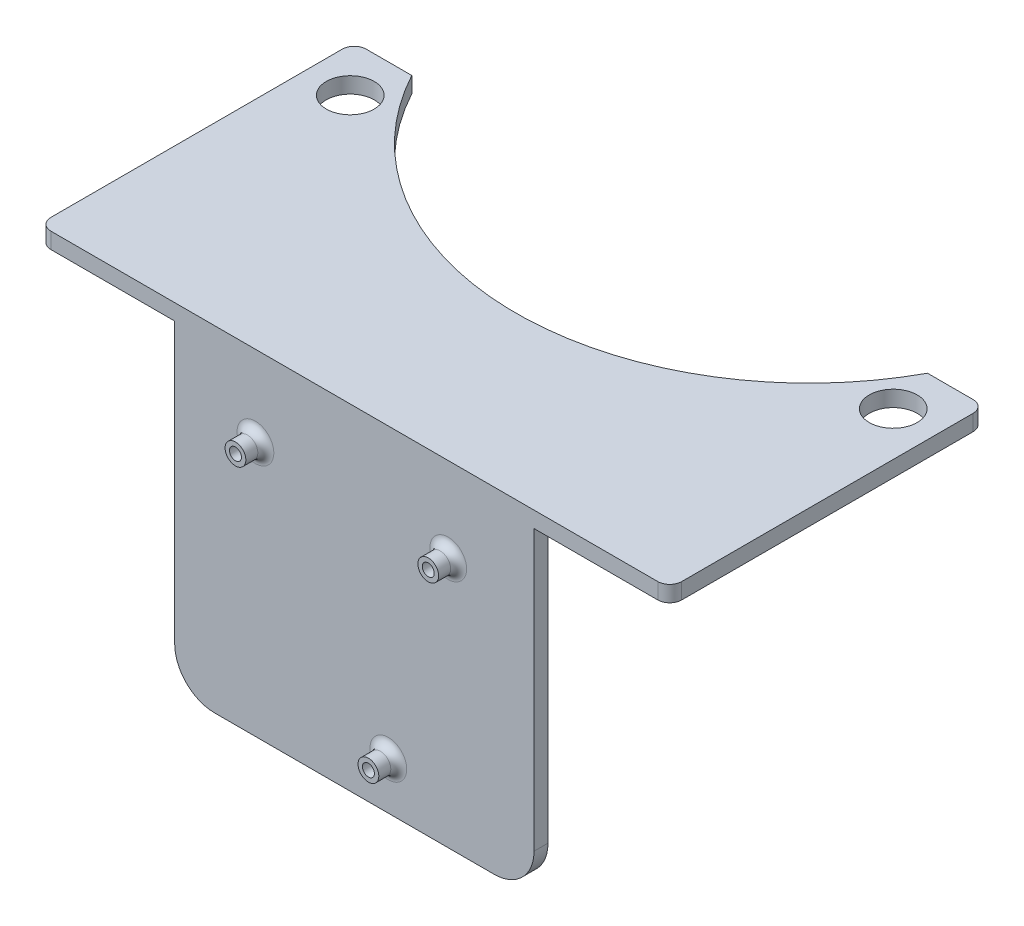
ISO-10303-21;
HEADER;
FILE_DESCRIPTION(('STEP AP214'),'2;1');
FILE_NAME('part.step','',(''),(''),'','','');
FILE_SCHEMA(('AUTOMOTIVE_DESIGN { 1 0 10303 214 1 1 1 1 }'));
ENDSEC;
DATA;
#1=APPLICATION_CONTEXT('core data for automotive mechanical design processes');
#2=APPLICATION_PROTOCOL_DEFINITION('international standard','automotive_design',2000,#1);
#3=PRODUCT_CONTEXT('',#1,'mechanical');
#4=PRODUCT('Part','Part','',(#3));
#5=PRODUCT_RELATED_PRODUCT_CATEGORY('part','',(#4));
#6=PRODUCT_DEFINITION_FORMATION('','',#4);
#7=PRODUCT_DEFINITION_CONTEXT('part definition',#1,'design');
#8=PRODUCT_DEFINITION('design','',#6,#7);
#9=PRODUCT_DEFINITION_SHAPE('','',#8);
#10=(LENGTH_UNIT() NAMED_UNIT(*) SI_UNIT(.MILLI.,.METRE.));
#11=(NAMED_UNIT(*) PLANE_ANGLE_UNIT() SI_UNIT($,.RADIAN.));
#12=(NAMED_UNIT(*) SI_UNIT($,.STERADIAN.) SOLID_ANGLE_UNIT());
#13=UNCERTAINTY_MEASURE_WITH_UNIT(LENGTH_MEASURE(1.E-05),#10,'distance_accuracy_value','');
#14=(GEOMETRIC_REPRESENTATION_CONTEXT(3) GLOBAL_UNCERTAINTY_ASSIGNED_CONTEXT((#13)) GLOBAL_UNIT_ASSIGNED_CONTEXT((#10,
#11,#12)) REPRESENTATION_CONTEXT('',''));
#15=CARTESIAN_POINT('',(0.,0.,0.));
#16=DIRECTION('',(0.,0.,1.));
#17=DIRECTION('',(1.,0.,0.));
#18=AXIS2_PLACEMENT_3D('',#15,#16,#17);
#19=CARTESIAN_POINT('',(-76.,0.,-84.4920957772645));
#20=DIRECTION('',(0.,-1.,0.));
#21=DIRECTION('',(0.,0.,-1.));
#22=AXIS2_PLACEMENT_3D('',#19,#20,#21);
#23=PLANE('',#22);
#24=DIRECTION('',(-1.,0.,0.));
#25=VECTOR('',#24,1.);
#26=CARTESIAN_POINT('',(-76.,0.,-30.3194952335633));
#27=LINE('',#26,#25);
#28=CARTESIAN_POINT('',(14.5,0.,-30.3194952335633));
#29=VERTEX_POINT('',#28);
#30=CARTESIAN_POINT('',(-14.5,0.,-30.3194952335633));
#31=VERTEX_POINT('',#30);
#32=EDGE_CURVE('E434',#29,#31,#27,.T.);
#33=ORIENTED_EDGE('',*,*,#32,.T.);
#34=DIRECTION('',(0.,0.,1.));
#35=VECTOR('',#34,1.);
#36=CARTESIAN_POINT('',(-14.5,0.,-22.5194952335633));
#37=LINE('',#36,#35);
#38=CARTESIAN_POINT('',(-14.5,0.,-22.5194952335633));
#39=VERTEX_POINT('',#38);
#40=EDGE_CURVE('E220',#31,#39,#37,.T.);
#41=ORIENTED_EDGE('',*,*,#40,.T.);
#42=DIRECTION('',(-1.,0.,0.));
#43=VECTOR('',#42,1.);
#44=CARTESIAN_POINT('',(14.5,0.,-22.5194952335633));
#45=LINE('',#44,#43);
#46=CARTESIAN_POINT('',(14.5,0.,-22.5194952335633));
#47=VERTEX_POINT('',#46);
#48=EDGE_CURVE('E491',#47,#39,#45,.T.);
#49=ORIENTED_EDGE('',*,*,#48,.F.);
#50=DIRECTION('',(0.,0.,1.));
#51=VECTOR('',#50,1.);
#52=CARTESIAN_POINT('',(14.5,0.,-22.5194952335633));
#53=LINE('',#52,#51);
#54=EDGE_CURVE('E215',#29,#47,#53,.T.);
#55=ORIENTED_EDGE('',*,*,#54,.F.);
#56=EDGE_LOOP('',(#33,#41,#49,#55));
#57=FACE_BOUND('',#56,.T.);
#58=CARTESIAN_POINT('',(68.,0.,-75.4920957772645));
#59=DIRECTION('',(0.,1.,0.));
#60=DIRECTION('',(0.,0.,1.));
#61=AXIS2_PLACEMENT_3D('',#58,#59,#60);
#62=CIRCLE('',#61,6.);
#63=CARTESIAN_POINT('',(68.,0.,-69.4920957772645));
#64=VERTEX_POINT('',#63);
#65=EDGE_CURVE('E269',#64,#64,#62,.T.);
#66=ORIENTED_EDGE('',*,*,#65,.T.);
#67=EDGE_LOOP('',(#66));
#68=FACE_BOUND('',#67,.T.);
#69=CARTESIAN_POINT('',(-68.,0.,-75.4920957772645));
#70=DIRECTION('',(0.,1.,0.));
#71=DIRECTION('',(0.,0.,1.));
#72=AXIS2_PLACEMENT_3D('',#69,#70,#71);
#73=CIRCLE('',#72,6.);
#74=CARTESIAN_POINT('',(-68.,0.,-69.4920957772645));
#75=VERTEX_POINT('',#74);
#76=EDGE_CURVE('E264',#75,#75,#73,.T.);
#77=ORIENTED_EDGE('',*,*,#76,.T.);
#78=EDGE_LOOP('',(#77));
#79=FACE_BOUND('',#78,.T.);
#80=DIRECTION('',(-1.,0.,0.));
#81=VECTOR('',#80,1.);
#82=CARTESIAN_POINT('',(45.,0.,-12.0206988089807));
#83=LINE('',#82,#81);
#84=CARTESIAN_POINT('',(45.,0.,-12.0206988089807));
#85=VERTEX_POINT('',#84);
#86=CARTESIAN_POINT('',(-45.,0.,-12.0206988089807));
#87=VERTEX_POINT('',#86);
#88=EDGE_CURVE('E246',#85,#87,#83,.T.);
#89=ORIENTED_EDGE('',*,*,#88,.T.);
#90=DIRECTION('',(0.,0.,1.));
#91=VECTOR('',#90,1.);
#92=CARTESIAN_POINT('',(-45.,0.,-8.52069880898069));
#93=LINE('',#92,#91);
#94=CARTESIAN_POINT('',(-45.,0.,-8.52069880898069));
#95=VERTEX_POINT('',#94);
#96=EDGE_CURVE('E241',#87,#95,#93,.T.);
#97=ORIENTED_EDGE('',*,*,#96,.T.);
#98=DIRECTION('',(1.,0.,0.));
#99=VECTOR('',#98,1.);
#100=CARTESIAN_POINT('',(-76.,0.,-8.52069880898069));
#101=LINE('',#100,#99);
#102=CARTESIAN_POINT('',(-76.,0.,-8.52069880898069));
#103=VERTEX_POINT('',#102);
#104=EDGE_CURVE('E324',#103,#95,#101,.T.);
#105=ORIENTED_EDGE('',*,*,#104,.F.);
#106=CARTESIAN_POINT('',(-76.,0.,-11.5206988089807));
#107=DIRECTION('',(0.,1.,0.));
#108=DIRECTION('',(0.,0.,1.));
#109=AXIS2_PLACEMENT_3D('',#106,#107,#108);
#110=CIRCLE('',#109,3.);
#111=CARTESIAN_POINT('',(-79.,0.,-11.5206988089807));
#112=VERTEX_POINT('',#111);
#113=EDGE_CURVE('E320',#112,#103,#110,.T.);
#114=ORIENTED_EDGE('',*,*,#113,.F.);
#115=DIRECTION('',(0.,0.,1.));
#116=VECTOR('',#115,1.);
#117=CARTESIAN_POINT('',(-79.,0.,-11.5206988089807));
#118=LINE('',#117,#116);
#119=CARTESIAN_POINT('',(-79.,0.,-84.4920957772645));
#120=VERTEX_POINT('',#119);
#121=EDGE_CURVE('E317',#120,#112,#118,.T.);
#122=ORIENTED_EDGE('',*,*,#121,.F.);
#123=CARTESIAN_POINT('',(-76.,0.,-84.4920957772645));
#124=DIRECTION('',(0.,1.,0.));
#125=DIRECTION('',(0.,0.,-1.));
#126=AXIS2_PLACEMENT_3D('',#123,#124,#125);
#127=CIRCLE('',#126,3.);
#128=CARTESIAN_POINT('',(-76.,0.,-87.4920957772645));
#129=VERTEX_POINT('',#128);
#130=EDGE_CURVE('E277',#129,#120,#127,.T.);
#131=ORIENTED_EDGE('',*,*,#130,.F.);
#132=DIRECTION('',(-1.,0.,0.));
#133=VECTOR('',#132,1.);
#134=CARTESIAN_POINT('',(-64.5886993316612,0.,-87.4920957772645));
#135=LINE('',#134,#133);
#136=CARTESIAN_POINT('',(-64.5886993316613,0.,-87.4920957772645));
#137=VERTEX_POINT('',#136);
#138=EDGE_CURVE('E286',#137,#129,#135,.T.);
#139=ORIENTED_EDGE('',*,*,#138,.F.);
#140=CARTESIAN_POINT('',(0.,0.,-122.389858218811));
#141=DIRECTION('',(0.,-1.,0.));
#142=DIRECTION('',(0.,0.,1.));
#143=AXIS2_PLACEMENT_3D('',#140,#141,#142);
#144=CIRCLE('',#143,73.4135812011809);
#145=CARTESIAN_POINT('',(64.5886993316612,0.,-87.4920957772645));
#146=VERTEX_POINT('',#145);
#147=EDGE_CURVE('E340',#146,#137,#144,.T.);
#148=ORIENTED_EDGE('',*,*,#147,.F.);
#149=DIRECTION('',(-1.,0.,0.));
#150=VECTOR('',#149,1.);
#151=CARTESIAN_POINT('',(76.,0.,-87.4920957772645));
#152=LINE('',#151,#150);
#153=CARTESIAN_POINT('',(76.,0.,-87.4920957772645));
#154=VERTEX_POINT('',#153);
#155=EDGE_CURVE('E337',#154,#146,#152,.T.);
#156=ORIENTED_EDGE('',*,*,#155,.F.);
#157=CARTESIAN_POINT('',(76.,0.,-84.4920957772645));
#158=DIRECTION('',(0.,1.,0.));
#159=DIRECTION('',(0.,0.,1.));
#160=AXIS2_PLACEMENT_3D('',#157,#158,#159);
#161=CIRCLE('',#160,3.);
#162=CARTESIAN_POINT('',(79.,0.,-84.4920957772645));
#163=VERTEX_POINT('',#162);
#164=EDGE_CURVE('E334',#163,#154,#161,.T.);
#165=ORIENTED_EDGE('',*,*,#164,.F.);
#166=DIRECTION('',(0.,0.,-1.));
#167=VECTOR('',#166,1.);
#168=CARTESIAN_POINT('',(79.,0.,-11.5206974274576));
#169=LINE('',#168,#167);
#170=CARTESIAN_POINT('',(79.,0.,-11.5206974274576));
#171=VERTEX_POINT('',#170);
#172=EDGE_CURVE('E331',#171,#163,#169,.T.);
#173=ORIENTED_EDGE('',*,*,#172,.F.);
#174=CARTESIAN_POINT('',(76.,0.,-11.5206974274576));
#175=DIRECTION('',(0.,1.,0.));
#176=DIRECTION('',(0.,0.,-1.));
#177=AXIS2_PLACEMENT_3D('',#174,#175,#176);
#178=CIRCLE('',#177,3.);
#179=CARTESIAN_POINT('',(76.0028790860208,0.,-8.52069880898069));
#180=VERTEX_POINT('',#179);
#181=EDGE_CURVE('E328',#180,#171,#178,.T.);
#182=ORIENTED_EDGE('',*,*,#181,.F.);
#183=CARTESIAN_POINT('',(45.,0.,-8.52069880898069));
#184=VERTEX_POINT('',#183);
#185=EDGE_CURVE('E323',#184,#180,#101,.T.);
#186=ORIENTED_EDGE('',*,*,#185,.F.);
#187=DIRECTION('',(0.,0.,1.));
#188=VECTOR('',#187,1.);
#189=CARTESIAN_POINT('',(45.,0.,-8.52069880898069));
#190=LINE('',#189,#188);
#191=EDGE_CURVE('E244',#85,#184,#190,.T.);
#192=ORIENTED_EDGE('',*,*,#191,.F.);
#193=EDGE_LOOP('',(#89,#97,#105,#114,#122,#131,#139,#148,#156,#165,#173,#182,#186,#192));
#194=FACE_BOUND('',#193,.T.);
#195=ADVANCED_FACE('F39',(#57,#68,#79,#194),#23,.T.);
#196=CARTESIAN_POINT('',(-76.,4.,-84.4920957772645));
#197=DIRECTION('',(0.,-1.,0.));
#198=DIRECTION('',(0.,0.,-1.));
#199=AXIS2_PLACEMENT_3D('',#196,#197,#198);
#200=PLANE('',#199);
#201=CARTESIAN_POINT('',(-76.,4.,-84.4920957772645));
#202=DIRECTION('',(0.,1.,0.));
#203=DIRECTION('',(0.,0.,-1.));
#204=AXIS2_PLACEMENT_3D('',#201,#202,#203);
#205=CIRCLE('',#204,3.);
#206=CARTESIAN_POINT('',(-76.,4.,-87.4920957772645));
#207=VERTEX_POINT('',#206);
#208=CARTESIAN_POINT('',(-79.,4.,-84.4920957772645));
#209=VERTEX_POINT('',#208);
#210=EDGE_CURVE('E281',#207,#209,#205,.T.);
#211=ORIENTED_EDGE('',*,*,#210,.T.);
#212=DIRECTION('',(0.,0.,1.));
#213=VECTOR('',#212,1.);
#214=CARTESIAN_POINT('',(-79.,4.,-11.5206988089807));
#215=LINE('',#214,#213);
#216=CARTESIAN_POINT('',(-79.,4.,-11.5206988089807));
#217=VERTEX_POINT('',#216);
#218=EDGE_CURVE('E285',#209,#217,#215,.T.);
#219=ORIENTED_EDGE('',*,*,#218,.T.);
#220=CARTESIAN_POINT('',(-76.,4.,-11.5206988089807));
#221=DIRECTION('',(0.,1.,0.));
#222=DIRECTION('',(0.,0.,1.));
#223=AXIS2_PLACEMENT_3D('',#220,#221,#222);
#224=CIRCLE('',#223,3.);
#225=CARTESIAN_POINT('',(-76.,4.,-8.52069880898069));
#226=VERTEX_POINT('',#225);
#227=EDGE_CURVE('E289',#217,#226,#224,.T.);
#228=ORIENTED_EDGE('',*,*,#227,.T.);
#229=DIRECTION('',(1.,0.,0.));
#230=VECTOR('',#229,1.);
#231=CARTESIAN_POINT('',(-76.,4.,-8.52069880898069));
#232=LINE('',#231,#230);
#233=CARTESIAN_POINT('',(76.0028790860208,4.,-8.52069880898069));
#234=VERTEX_POINT('',#233);
#235=EDGE_CURVE('E292',#226,#234,#232,.T.);
#236=ORIENTED_EDGE('',*,*,#235,.T.);
#237=CARTESIAN_POINT('',(76.,4.,-11.5206974274576));
#238=DIRECTION('',(0.,1.,0.));
#239=DIRECTION('',(0.,0.,-1.));
#240=AXIS2_PLACEMENT_3D('',#237,#238,#239);
#241=CIRCLE('',#240,3.);
#242=CARTESIAN_POINT('',(79.,4.,-11.5206974274576));
#243=VERTEX_POINT('',#242);
#244=EDGE_CURVE('E295',#234,#243,#241,.T.);
#245=ORIENTED_EDGE('',*,*,#244,.T.);
#246=DIRECTION('',(0.,0.,-1.));
#247=VECTOR('',#246,1.);
#248=CARTESIAN_POINT('',(79.,4.,-11.5206974274576));
#249=LINE('',#248,#247);
#250=CARTESIAN_POINT('',(79.,4.,-84.4920957772645));
#251=VERTEX_POINT('',#250);
#252=EDGE_CURVE('E298',#243,#251,#249,.T.);
#253=ORIENTED_EDGE('',*,*,#252,.T.);
#254=CARTESIAN_POINT('',(76.,4.,-84.4920957772645));
#255=DIRECTION('',(0.,1.,0.));
#256=DIRECTION('',(0.,0.,1.));
#257=AXIS2_PLACEMENT_3D('',#254,#255,#256);
#258=CIRCLE('',#257,3.);
#259=CARTESIAN_POINT('',(76.,4.,-87.4920957772645));
#260=VERTEX_POINT('',#259);
#261=EDGE_CURVE('E301',#251,#260,#258,.T.);
#262=ORIENTED_EDGE('',*,*,#261,.T.);
#263=DIRECTION('',(-1.,0.,0.));
#264=VECTOR('',#263,1.);
#265=CARTESIAN_POINT('',(76.,4.,-87.4920957772645));
#266=LINE('',#265,#264);
#267=CARTESIAN_POINT('',(64.5886993316612,4.,-87.4920957772645));
#268=VERTEX_POINT('',#267);
#269=EDGE_CURVE('E304',#260,#268,#266,.T.);
#270=ORIENTED_EDGE('',*,*,#269,.T.);
#271=CARTESIAN_POINT('',(0.,4.,-122.389858218811));
#272=DIRECTION('',(0.,-1.,0.));
#273=DIRECTION('',(0.,0.,1.));
#274=AXIS2_PLACEMENT_3D('',#271,#272,#273);
#275=CIRCLE('',#274,73.4135812011809);
#276=CARTESIAN_POINT('',(-64.5886993316613,4.,-87.4920957772645));
#277=VERTEX_POINT('',#276);
#278=EDGE_CURVE('E307',#268,#277,#275,.T.);
#279=ORIENTED_EDGE('',*,*,#278,.T.);
#280=DIRECTION('',(-1.,0.,0.));
#281=VECTOR('',#280,1.);
#282=CARTESIAN_POINT('',(-64.5886993316612,4.,-87.4920957772645));
#283=LINE('',#282,#281);
#284=EDGE_CURVE('E310',#277,#207,#283,.T.);
#285=ORIENTED_EDGE('',*,*,#284,.T.);
#286=EDGE_LOOP('',(#211,#219,#228,#236,#245,#253,#262,#270,#279,#285));
#287=FACE_BOUND('',#286,.T.);
#288=CARTESIAN_POINT('',(68.,4.,-75.4920957772645));
#289=DIRECTION('',(0.,1.,0.));
#290=DIRECTION('',(0.,0.,1.));
#291=AXIS2_PLACEMENT_3D('',#288,#289,#290);
#292=CIRCLE('',#291,6.);
#293=CARTESIAN_POINT('',(68.,4.,-69.4920957772645));
#294=VERTEX_POINT('',#293);
#295=EDGE_CURVE('E273',#294,#294,#292,.T.);
#296=ORIENTED_EDGE('',*,*,#295,.F.);
#297=EDGE_LOOP('',(#296));
#298=FACE_BOUND('',#297,.T.);
#299=CARTESIAN_POINT('',(-68.,4.,-75.4920957772645));
#300=DIRECTION('',(0.,1.,0.));
#301=DIRECTION('',(0.,0.,1.));
#302=AXIS2_PLACEMENT_3D('',#299,#300,#301);
#303=CIRCLE('',#302,6.);
#304=CARTESIAN_POINT('',(-68.,4.,-69.4920957772645));
#305=VERTEX_POINT('',#304);
#306=EDGE_CURVE('E265',#305,#305,#303,.T.);
#307=ORIENTED_EDGE('',*,*,#306,.F.);
#308=EDGE_LOOP('',(#307));
#309=FACE_BOUND('',#308,.T.);
#310=ADVANCED_FACE('F533',(#287,#298,#309),#200,.F.);
#311=CARTESIAN_POINT('',(-76.,4.,-84.4920957772645));
#312=DIRECTION('',(0.,-1.,0.));
#313=DIRECTION('',(0.,0.,-1.));
#314=AXIS2_PLACEMENT_3D('',#311,#312,#313);
#315=CYLINDRICAL_SURFACE('',#314,3.);
#316=ORIENTED_EDGE('',*,*,#130,.T.);
#317=DIRECTION('',(0.,-1.,0.));
#318=VECTOR('',#317,1.);
#319=CARTESIAN_POINT('',(-79.,4.,-84.4920957772645));
#320=LINE('',#319,#318);
#321=EDGE_CURVE('E380',#209,#120,#320,.T.);
#322=ORIENTED_EDGE('',*,*,#321,.F.);
#323=ORIENTED_EDGE('',*,*,#210,.F.);
#324=DIRECTION('',(0.,-1.,0.));
#325=VECTOR('',#324,1.);
#326=CARTESIAN_POINT('',(-76.,4.,-87.4920957772645));
#327=LINE('',#326,#325);
#328=EDGE_CURVE('E313',#207,#129,#327,.T.);
#329=ORIENTED_EDGE('',*,*,#328,.T.);
#330=EDGE_LOOP('',(#316,#322,#323,#329));
#331=FACE_BOUND('',#330,.T.);
#332=ADVANCED_FACE('F597',(#331),#315,.T.);
#333=CARTESIAN_POINT('',(-79.,4.,-11.5206988089807));
#334=DIRECTION('',(1.,0.,0.));
#335=DIRECTION('',(0.,0.,-1.));
#336=AXIS2_PLACEMENT_3D('',#333,#334,#335);
#337=PLANE('',#336);
#338=ORIENTED_EDGE('',*,*,#121,.T.);
#339=DIRECTION('',(0.,-1.,0.));
#340=VECTOR('',#339,1.);
#341=CARTESIAN_POINT('',(-79.,4.,-11.5206988089807));
#342=LINE('',#341,#340);
#343=EDGE_CURVE('E376',#217,#112,#342,.T.);
#344=ORIENTED_EDGE('',*,*,#343,.F.);
#345=ORIENTED_EDGE('',*,*,#218,.F.);
#346=ORIENTED_EDGE('',*,*,#321,.T.);
#347=EDGE_LOOP('',(#338,#344,#345,#346));
#348=FACE_BOUND('',#347,.T.);
#349=ADVANCED_FACE('F593',(#348),#337,.F.);
#350=CARTESIAN_POINT('',(-76.,4.,-11.5206988089807));
#351=DIRECTION('',(0.,-1.,0.));
#352=DIRECTION('',(0.,0.,-1.));
#353=AXIS2_PLACEMENT_3D('',#350,#351,#352);
#354=CYLINDRICAL_SURFACE('',#353,3.);
#355=ORIENTED_EDGE('',*,*,#113,.T.);
#356=DIRECTION('',(0.,-1.,0.));
#357=VECTOR('',#356,1.);
#358=CARTESIAN_POINT('',(-76.,4.,-8.52069880898069));
#359=LINE('',#358,#357);
#360=EDGE_CURVE('E372',#226,#103,#359,.T.);
#361=ORIENTED_EDGE('',*,*,#360,.F.);
#362=ORIENTED_EDGE('',*,*,#227,.F.);
#363=ORIENTED_EDGE('',*,*,#343,.T.);
#364=EDGE_LOOP('',(#355,#361,#362,#363));
#365=FACE_BOUND('',#364,.T.);
#366=ADVANCED_FACE('F590',(#365),#354,.T.);
#367=CARTESIAN_POINT('',(-76.,4.,-8.52069880898069));
#368=DIRECTION('',(0.,0.,-1.));
#369=DIRECTION('',(-1.,0.,0.));
#370=AXIS2_PLACEMENT_3D('',#367,#368,#369);
#371=PLANE('',#370);
#372=CARTESIAN_POINT('',(-24.7777207504887,-16.2079743920055,-8.52069880898069));
#373=DIRECTION('',(0.,0.,-1.));
#374=DIRECTION('',(-1.,0.,0.));
#375=AXIS2_PLACEMENT_3D('',#372,#373,#374);
#376=CIRCLE('',#375,4.6);
#377=CARTESIAN_POINT('',(-29.3777207504887,-16.2079743920055,-8.52069880898069));
#378=VERTEX_POINT('',#377);
#379=EDGE_CURVE('E400',#378,#378,#376,.T.);
#380=ORIENTED_EDGE('',*,*,#379,.T.);
#381=EDGE_LOOP('',(#380));
#382=FACE_BOUND('',#381,.T.);
#383=CARTESIAN_POINT('',(23.5119261730497,-17.2079743920058,-8.52069880898069));
#384=DIRECTION('',(0.,0.,-1.));
#385=DIRECTION('',(-1.,0.,0.));
#386=AXIS2_PLACEMENT_3D('',#383,#384,#385);
#387=CIRCLE('',#386,4.60000000000002);
#388=CARTESIAN_POINT('',(18.9119261730497,-17.2079743920058,-8.52069880898069));
#389=VERTEX_POINT('',#388);
#390=EDGE_CURVE('E396',#389,#389,#387,.T.);
#391=ORIENTED_EDGE('',*,*,#390,.T.);
#392=EDGE_LOOP('',(#391));
#393=FACE_BOUND('',#392,.T.);
#394=CARTESIAN_POINT('',(8.52432510082934,-68.1489384003555,-8.52069880898069));
#395=DIRECTION('',(0.,0.,-1.));
#396=DIRECTION('',(-1.,0.,0.));
#397=AXIS2_PLACEMENT_3D('',#394,#395,#396);
#398=CIRCLE('',#397,4.59999999999999);
#399=CARTESIAN_POINT('',(3.92432510082935,-68.1489384003555,-8.52069880898069));
#400=VERTEX_POINT('',#399);
#401=EDGE_CURVE('E388',#400,#400,#398,.T.);
#402=ORIENTED_EDGE('',*,*,#401,.T.);
#403=EDGE_LOOP('',(#402));
#404=FACE_BOUND('',#403,.T.);
#405=DIRECTION('',(0.,-1.,0.));
#406=VECTOR('',#405,1.);
#407=CARTESIAN_POINT('',(-45.,-80.,-8.52069880898069));
#408=LINE('',#407,#406);
#409=CARTESIAN_POINT('',(-45.,-70.,-8.52069880898069));
#410=VERTEX_POINT('',#409);
#411=EDGE_CURVE('E225',#95,#410,#408,.T.);
#412=ORIENTED_EDGE('',*,*,#411,.T.);
#413=CARTESIAN_POINT('',(-35.,-70.,-8.52069880898069));
#414=DIRECTION('',(0.,0.,-1.));
#415=DIRECTION('',(-1.,0.,0.));
#416=AXIS2_PLACEMENT_3D('',#413,#414,#415);
#417=CIRCLE('',#416,10.);
#418=CARTESIAN_POINT('',(-35.,-80.,-8.52069880898069));
#419=VERTEX_POINT('',#418);
#420=EDGE_CURVE('E431',#410,#419,#417,.F.);
#421=ORIENTED_EDGE('',*,*,#420,.T.);
#422=DIRECTION('',(-1.,0.,0.));
#423=VECTOR('',#422,1.);
#424=CARTESIAN_POINT('',(45.,-80.,-8.52069880898069));
#425=LINE('',#424,#423);
#426=CARTESIAN_POINT('',(35.,-80.,-8.52069880898069));
#427=VERTEX_POINT('',#426);
#428=EDGE_CURVE('E260',#427,#419,#425,.T.);
#429=ORIENTED_EDGE('',*,*,#428,.F.);
#430=CARTESIAN_POINT('',(35.,-70.,-8.52069880898069));
#431=DIRECTION('',(0.,0.,-1.));
#432=DIRECTION('',(-1.,0.,0.));
#433=AXIS2_PLACEMENT_3D('',#430,#431,#432);
#434=CIRCLE('',#433,10.);
#435=CARTESIAN_POINT('',(45.,-70.,-8.52069880898069));
#436=VERTEX_POINT('',#435);
#437=EDGE_CURVE('E418',#427,#436,#434,.F.);
#438=ORIENTED_EDGE('',*,*,#437,.T.);
#439=DIRECTION('',(0.,-1.,0.));
#440=VECTOR('',#439,1.);
#441=CARTESIAN_POINT('',(45.,-80.,-8.52069880898069));
#442=LINE('',#441,#440);
#443=EDGE_CURVE('E236',#184,#436,#442,.T.);
#444=ORIENTED_EDGE('',*,*,#443,.F.);
#445=ORIENTED_EDGE('',*,*,#185,.T.);
#446=DIRECTION('',(0.,-1.,0.));
#447=VECTOR('',#446,1.);
#448=CARTESIAN_POINT('',(76.0028790860208,4.,-8.52069880898069));
#449=LINE('',#448,#447);
#450=EDGE_CURVE('E368',#234,#180,#449,.T.);
#451=ORIENTED_EDGE('',*,*,#450,.F.);
#452=ORIENTED_EDGE('',*,*,#235,.F.);
#453=ORIENTED_EDGE('',*,*,#360,.T.);
#454=ORIENTED_EDGE('',*,*,#104,.T.);
#455=EDGE_LOOP('',(#412,#421,#429,#438,#444,#445,#451,#452,#453,#454));
#456=FACE_BOUND('',#455,.T.);
#457=ADVANCED_FACE('F551',(#382,#393,#404,#456),#371,.F.);
#458=CARTESIAN_POINT('',(76.,4.,-11.5206974274576));
#459=DIRECTION('',(0.,-1.,0.));
#460=DIRECTION('',(0.,0.,-1.));
#461=AXIS2_PLACEMENT_3D('',#458,#459,#460);
#462=CYLINDRICAL_SURFACE('',#461,3.);
#463=ORIENTED_EDGE('',*,*,#181,.T.);
#464=DIRECTION('',(0.,-1.,0.));
#465=VECTOR('',#464,1.);
#466=CARTESIAN_POINT('',(79.,4.,-11.5206974274576));
#467=LINE('',#466,#465);
#468=EDGE_CURVE('E364',#243,#171,#467,.T.);
#469=ORIENTED_EDGE('',*,*,#468,.F.);
#470=ORIENTED_EDGE('',*,*,#244,.F.);
#471=ORIENTED_EDGE('',*,*,#450,.T.);
#472=EDGE_LOOP('',(#463,#469,#470,#471));
#473=FACE_BOUND('',#472,.T.);
#474=ADVANCED_FACE('F574',(#473),#462,.T.);
#475=CARTESIAN_POINT('',(79.,4.,-11.5206974274576));
#476=DIRECTION('',(-1.,0.,0.));
#477=DIRECTION('',(0.,0.,1.));
#478=AXIS2_PLACEMENT_3D('',#475,#476,#477);
#479=PLANE('',#478);
#480=ORIENTED_EDGE('',*,*,#172,.T.);
#481=DIRECTION('',(0.,-1.,0.));
#482=VECTOR('',#481,1.);
#483=CARTESIAN_POINT('',(79.,4.,-84.4920957772645));
#484=LINE('',#483,#482);
#485=EDGE_CURVE('E360',#251,#163,#484,.T.);
#486=ORIENTED_EDGE('',*,*,#485,.F.);
#487=ORIENTED_EDGE('',*,*,#252,.F.);
#488=ORIENTED_EDGE('',*,*,#468,.T.);
#489=EDGE_LOOP('',(#480,#486,#487,#488));
#490=FACE_BOUND('',#489,.T.);
#491=ADVANCED_FACE('F578',(#490),#479,.F.);
#492=CARTESIAN_POINT('',(76.,4.,-84.4920957772645));
#493=DIRECTION('',(0.,-1.,0.));
#494=DIRECTION('',(0.,0.,-1.));
#495=AXIS2_PLACEMENT_3D('',#492,#493,#494);
#496=CYLINDRICAL_SURFACE('',#495,3.);
#497=ORIENTED_EDGE('',*,*,#164,.T.);
#498=DIRECTION('',(0.,-1.,0.));
#499=VECTOR('',#498,1.);
#500=CARTESIAN_POINT('',(76.,4.,-87.4920957772645));
#501=LINE('',#500,#499);
#502=EDGE_CURVE('E356',#260,#154,#501,.T.);
#503=ORIENTED_EDGE('',*,*,#502,.F.);
#504=ORIENTED_EDGE('',*,*,#261,.F.);
#505=ORIENTED_EDGE('',*,*,#485,.T.);
#506=EDGE_LOOP('',(#497,#503,#504,#505));
#507=FACE_BOUND('',#506,.T.);
#508=ADVANCED_FACE('F614',(#507),#496,.T.);
#509=CARTESIAN_POINT('',(76.,4.,-87.4920957772645));
#510=DIRECTION('',(0.,0.,1.));
#511=DIRECTION('',(1.,0.,0.));
#512=AXIS2_PLACEMENT_3D('',#509,#510,#511);
#513=PLANE('',#512);
#514=ORIENTED_EDGE('',*,*,#155,.T.);
#515=DIRECTION('',(0.,-1.,0.));
#516=VECTOR('',#515,1.);
#517=CARTESIAN_POINT('',(64.5886993316612,4.,-87.4920957772645));
#518=LINE('',#517,#516);
#519=EDGE_CURVE('E352',#268,#146,#518,.T.);
#520=ORIENTED_EDGE('',*,*,#519,.F.);
#521=ORIENTED_EDGE('',*,*,#269,.F.);
#522=ORIENTED_EDGE('',*,*,#502,.T.);
#523=EDGE_LOOP('',(#514,#520,#521,#522));
#524=FACE_BOUND('',#523,.T.);
#525=ADVANCED_FACE('F612',(#524),#513,.F.);
#526=CARTESIAN_POINT('',(0.,4.,-122.389858218811));
#527=DIRECTION('',(0.,-1.,0.));
#528=DIRECTION('',(0.,0.,-1.));
#529=AXIS2_PLACEMENT_3D('',#526,#527,#528);
#530=CYLINDRICAL_SURFACE('',#529,73.4135812011809);
#531=ORIENTED_EDGE('',*,*,#147,.T.);
#532=DIRECTION('',(0.,-1.,0.));
#533=VECTOR('',#532,1.);
#534=CARTESIAN_POINT('',(-64.5886993316613,4.,-87.4920957772645));
#535=LINE('',#534,#533);
#536=EDGE_CURVE('E348',#277,#137,#535,.T.);
#537=ORIENTED_EDGE('',*,*,#536,.F.);
#538=ORIENTED_EDGE('',*,*,#278,.F.);
#539=ORIENTED_EDGE('',*,*,#519,.T.);
#540=EDGE_LOOP('',(#531,#537,#538,#539));
#541=FACE_BOUND('',#540,.T.);
#542=ADVANCED_FACE('F608',(#541),#530,.F.);
#543=CARTESIAN_POINT('',(-64.5886993316612,4.,-87.4920957772645));
#544=DIRECTION('',(0.,0.,1.));
#545=DIRECTION('',(1.,0.,0.));
#546=AXIS2_PLACEMENT_3D('',#543,#544,#545);
#547=PLANE('',#546);
#548=ORIENTED_EDGE('',*,*,#138,.T.);
#549=ORIENTED_EDGE('',*,*,#328,.F.);
#550=ORIENTED_EDGE('',*,*,#284,.F.);
#551=ORIENTED_EDGE('',*,*,#536,.T.);
#552=EDGE_LOOP('',(#548,#549,#550,#551));
#553=FACE_BOUND('',#552,.T.);
#554=ADVANCED_FACE('F603',(#553),#547,.F.);
#555=CARTESIAN_POINT('',(68.,4.,-75.4920957772645));
#556=DIRECTION('',(0.,-1.,0.));
#557=DIRECTION('',(0.,0.,-1.));
#558=AXIS2_PLACEMENT_3D('',#555,#556,#557);
#559=CYLINDRICAL_SURFACE('',#558,6.);
#560=ORIENTED_EDGE('',*,*,#295,.T.);
#561=EDGE_LOOP('',(#560));
#562=FACE_BOUND('',#561,.T.);
#563=ORIENTED_EDGE('',*,*,#65,.F.);
#564=EDGE_LOOP('',(#563));
#565=FACE_BOUND('',#564,.T.);
#566=ADVANCED_FACE('F861',(#562,#565),#559,.F.);
#567=CARTESIAN_POINT('',(-68.,4.,-75.4920957772645));
#568=DIRECTION('',(0.,-1.,0.));
#569=DIRECTION('',(0.,0.,-1.));
#570=AXIS2_PLACEMENT_3D('',#567,#568,#569);
#571=CYLINDRICAL_SURFACE('',#570,6.);
#572=ORIENTED_EDGE('',*,*,#306,.T.);
#573=EDGE_LOOP('',(#572));
#574=FACE_BOUND('',#573,.T.);
#575=ORIENTED_EDGE('',*,*,#76,.F.);
#576=EDGE_LOOP('',(#575));
#577=FACE_BOUND('',#576,.T.);
#578=ADVANCED_FACE('F755',(#574,#577),#571,.F.);
#579=CARTESIAN_POINT('',(45.,-80.,-12.0206988089807));
#580=DIRECTION('',(0.,1.,0.));
#581=DIRECTION('',(0.,0.,1.));
#582=AXIS2_PLACEMENT_3D('',#579,#580,#581);
#583=PLANE('',#582);
#584=ORIENTED_EDGE('',*,*,#428,.T.);
#585=DIRECTION('',(0.,0.,-1.));
#586=VECTOR('',#585,1.);
#587=CARTESIAN_POINT('',(-35.,-80.,-12.0206988089807));
#588=LINE('',#587,#586);
#589=CARTESIAN_POINT('',(-35.,-80.,-12.0206988089807));
#590=VERTEX_POINT('',#589);
#591=EDGE_CURVE('E421',#419,#590,#588,.T.);
#592=ORIENTED_EDGE('',*,*,#591,.T.);
#593=DIRECTION('',(-1.,0.,0.));
#594=VECTOR('',#593,1.);
#595=CARTESIAN_POINT('',(45.,-80.,-12.0206988089807));
#596=LINE('',#595,#594);
#597=CARTESIAN_POINT('',(35.,-80.,-12.0206988089807));
#598=VERTEX_POINT('',#597);
#599=EDGE_CURVE('E256',#598,#590,#596,.T.);
#600=ORIENTED_EDGE('',*,*,#599,.F.);
#601=DIRECTION('',(0.,0.,-1.));
#602=VECTOR('',#601,1.);
#603=CARTESIAN_POINT('',(35.,-80.,-12.0206988089807));
#604=LINE('',#603,#602);
#605=EDGE_CURVE('E415',#598,#427,#604,.F.);
#606=ORIENTED_EDGE('',*,*,#605,.T.);
#607=EDGE_LOOP('',(#584,#592,#600,#606));
#608=FACE_BOUND('',#607,.T.);
#609=ADVANCED_FACE('F558',(#608),#583,.F.);
#610=CARTESIAN_POINT('',(45.,0.,-12.0206988089807));
#611=DIRECTION('',(0.,0.,1.));
#612=DIRECTION('',(0.,-1.,0.));
#613=AXIS2_PLACEMENT_3D('',#610,#611,#612);
#614=PLANE('',#613);
#615=CARTESIAN_POINT('',(-24.7777207504887,-16.2079743920055,-12.0206988089807));
#616=DIRECTION('',(0.,0.,1.));
#617=DIRECTION('',(0.,-1.,0.));
#618=AXIS2_PLACEMENT_3D('',#615,#616,#617);
#619=CIRCLE('',#618,1.5);
#620=CARTESIAN_POINT('',(-24.7777207504887,-17.7079743920055,-12.0206988089807));
#621=VERTEX_POINT('',#620);
#622=EDGE_CURVE('E43',#621,#621,#619,.T.);
#623=ORIENTED_EDGE('',*,*,#622,.T.);
#624=EDGE_LOOP('',(#623));
#625=FACE_BOUND('',#624,.T.);
#626=CARTESIAN_POINT('',(23.5119261730497,-17.2079743920058,-12.0206988089807));
#627=DIRECTION('',(0.,0.,1.));
#628=DIRECTION('',(0.,-1.,0.));
#629=AXIS2_PLACEMENT_3D('',#626,#627,#628);
#630=CIRCLE('',#629,1.49999999999999);
#631=CARTESIAN_POINT('',(23.5119261730497,-18.7079743920058,-12.0206988089807));
#632=VERTEX_POINT('',#631);
#633=EDGE_CURVE('E445',#632,#632,#630,.T.);
#634=ORIENTED_EDGE('',*,*,#633,.T.);
#635=EDGE_LOOP('',(#634));
#636=FACE_BOUND('',#635,.T.);
#637=CARTESIAN_POINT('',(8.52432510082934,-68.1489384003555,-12.0206988089807));
#638=DIRECTION('',(0.,0.,1.));
#639=DIRECTION('',(0.,-1.,0.));
#640=AXIS2_PLACEMENT_3D('',#637,#638,#639);
#641=CIRCLE('',#640,1.5);
#642=CARTESIAN_POINT('',(8.52432510082934,-69.6489384003555,-12.0206988089807));
#643=VERTEX_POINT('',#642);
#644=EDGE_CURVE('E442',#643,#643,#641,.T.);
#645=ORIENTED_EDGE('',*,*,#644,.T.);
#646=EDGE_LOOP('',(#645));
#647=FACE_BOUND('',#646,.T.);
#648=DIRECTION('',(-1.,0.,0.));
#649=VECTOR('',#648,1.);
#650=CARTESIAN_POINT('',(14.5,-28.2889250164,-12.0206988089807));
#651=LINE('',#650,#649);
#652=CARTESIAN_POINT('',(14.5,-28.2889250164,-12.0206988089807));
#653=VERTEX_POINT('',#652);
#654=CARTESIAN_POINT('',(-14.5,-28.2889250164,-12.0206988089807));
#655=VERTEX_POINT('',#654);
#656=EDGE_CURVE('E232',#653,#655,#651,.T.);
#657=ORIENTED_EDGE('',*,*,#656,.F.);
#658=DIRECTION('',(0.,-1.,0.));
#659=VECTOR('',#658,1.);
#660=CARTESIAN_POINT('',(14.5,-25.1370848901438,-12.0206988089807));
#661=LINE('',#660,#659);
#662=CARTESIAN_POINT('',(14.5,-25.1370848901438,-12.0206988089807));
#663=VERTEX_POINT('',#662);
#664=EDGE_CURVE('E210',#663,#653,#661,.T.);
#665=ORIENTED_EDGE('',*,*,#664,.F.);
#666=DIRECTION('',(-1.,0.,0.));
#667=VECTOR('',#666,1.);
#668=CARTESIAN_POINT('',(14.5,-25.1370848901438,-12.0206988089807));
#669=LINE('',#668,#667);
#670=CARTESIAN_POINT('',(-14.5,-25.1370848901438,-12.0206988089807));
#671=VERTEX_POINT('',#670);
#672=EDGE_CURVE('E206',#663,#671,#669,.T.);
#673=ORIENTED_EDGE('',*,*,#672,.T.);
#674=DIRECTION('',(0.,-1.,0.));
#675=VECTOR('',#674,1.);
#676=CARTESIAN_POINT('',(-14.5,-25.1370848901438,-12.0206988089807));
#677=LINE('',#676,#675);
#678=EDGE_CURVE('E497',#671,#655,#677,.T.);
#679=ORIENTED_EDGE('',*,*,#678,.T.);
#680=EDGE_LOOP('',(#657,#665,#673,#679));
#681=FACE_BOUND('',#680,.T.);
#682=ORIENTED_EDGE('',*,*,#599,.T.);
#683=CARTESIAN_POINT('',(-35.,-70.,-12.0206988089807));
#684=DIRECTION('',(0.,0.,1.));
#685=DIRECTION('',(0.,-1.,0.));
#686=AXIS2_PLACEMENT_3D('',#683,#684,#685);
#687=CIRCLE('',#686,10.);
#688=CARTESIAN_POINT('',(-45.,-70.,-12.0206988089807));
#689=VERTEX_POINT('',#688);
#690=EDGE_CURVE('E425',#590,#689,#687,.F.);
#691=ORIENTED_EDGE('',*,*,#690,.T.);
#692=DIRECTION('',(0.,1.,0.));
#693=VECTOR('',#692,1.);
#694=CARTESIAN_POINT('',(-45.,0.,-12.0206988089807));
#695=LINE('',#694,#693);
#696=EDGE_CURVE('E230',#689,#87,#695,.T.);
#697=ORIENTED_EDGE('',*,*,#696,.T.);
#698=ORIENTED_EDGE('',*,*,#88,.F.);
#699=DIRECTION('',(0.,1.,0.));
#700=VECTOR('',#699,1.);
#701=CARTESIAN_POINT('',(45.,0.,-12.0206988089807));
#702=LINE('',#701,#700);
#703=CARTESIAN_POINT('',(45.,-70.,-12.0206988089807));
#704=VERTEX_POINT('',#703);
#705=EDGE_CURVE('E240',#704,#85,#702,.T.);
#706=ORIENTED_EDGE('',*,*,#705,.F.);
#707=CARTESIAN_POINT('',(35.,-70.,-12.0206988089807));
#708=DIRECTION('',(0.,0.,1.));
#709=DIRECTION('',(0.,-1.,0.));
#710=AXIS2_PLACEMENT_3D('',#707,#708,#709);
#711=CIRCLE('',#710,10.);
#712=EDGE_CURVE('E412',#704,#598,#711,.F.);
#713=ORIENTED_EDGE('',*,*,#712,.T.);
#714=EDGE_LOOP('',(#682,#691,#697,#698,#706,#713));
#715=FACE_BOUND('',#714,.T.);
#716=ADVANCED_FACE('F528',(#625,#636,#647,#681,#715),#614,.F.);
#717=CARTESIAN_POINT('',(45.,0.,0.));
#718=DIRECTION('',(-1.,0.,0.));
#719=DIRECTION('',(0.,0.,1.));
#720=AXIS2_PLACEMENT_3D('',#717,#718,#719);
#721=PLANE('',#720);
#722=ORIENTED_EDGE('',*,*,#443,.T.);
#723=DIRECTION('',(0.,0.,-1.));
#724=VECTOR('',#723,1.);
#725=CARTESIAN_POINT('',(45.,-70.,0.));
#726=LINE('',#725,#724);
#727=EDGE_CURVE('E408',#436,#704,#726,.T.);
#728=ORIENTED_EDGE('',*,*,#727,.T.);
#729=ORIENTED_EDGE('',*,*,#705,.T.);
#730=ORIENTED_EDGE('',*,*,#191,.T.);
#731=EDGE_LOOP('',(#722,#728,#729,#730));
#732=FACE_BOUND('',#731,.T.);
#733=ADVANCED_FACE('F565',(#732),#721,.F.);
#734=CARTESIAN_POINT('',(-45.,0.,0.));
#735=DIRECTION('',(-1.,0.,0.));
#736=DIRECTION('',(0.,0.,1.));
#737=AXIS2_PLACEMENT_3D('',#734,#735,#736);
#738=PLANE('',#737);
#739=ORIENTED_EDGE('',*,*,#696,.F.);
#740=DIRECTION('',(0.,0.,-1.));
#741=VECTOR('',#740,1.);
#742=CARTESIAN_POINT('',(-45.,-70.,-8.52069880898069));
#743=LINE('',#742,#741);
#744=EDGE_CURVE('E428',#689,#410,#743,.F.);
#745=ORIENTED_EDGE('',*,*,#744,.T.);
#746=ORIENTED_EDGE('',*,*,#411,.F.);
#747=ORIENTED_EDGE('',*,*,#96,.F.);
#748=EDGE_LOOP('',(#739,#745,#746,#747));
#749=FACE_BOUND('',#748,.T.);
#750=ADVANCED_FACE('F548',(#749),#738,.T.);
#751=CARTESIAN_POINT('',(14.5,0.,-22.5194952335633));
#752=DIRECTION('',(0.,0.,-1.));
#753=DIRECTION('',(-1.,0.,0.));
#754=AXIS2_PLACEMENT_3D('',#751,#752,#753);
#755=PLANE('',#754);
#756=DIRECTION('',(0.,-1.,0.));
#757=VECTOR('',#756,1.);
#758=CARTESIAN_POINT('',(-14.5,0.,-22.5194952335633));
#759=LINE('',#758,#757);
#760=CARTESIAN_POINT('',(-14.5,-13.296388199614,-22.5194952335633));
#761=VERTEX_POINT('',#760);
#762=EDGE_CURVE('E223',#39,#761,#759,.T.);
#763=ORIENTED_EDGE('',*,*,#762,.T.);
#764=DIRECTION('',(-1.,0.,0.));
#765=VECTOR('',#764,1.);
#766=CARTESIAN_POINT('',(14.5,-13.296388199614,-22.5194952335633));
#767=LINE('',#766,#765);
#768=CARTESIAN_POINT('',(14.5,-13.296388199614,-22.5194952335633));
#769=VERTEX_POINT('',#768);
#770=EDGE_CURVE('E204',#769,#761,#767,.T.);
#771=ORIENTED_EDGE('',*,*,#770,.F.);
#772=DIRECTION('',(0.,-1.,0.));
#773=VECTOR('',#772,1.);
#774=CARTESIAN_POINT('',(14.5,0.,-22.5194952335633));
#775=LINE('',#774,#773);
#776=EDGE_CURVE('E211',#47,#769,#775,.T.);
#777=ORIENTED_EDGE('',*,*,#776,.F.);
#778=ORIENTED_EDGE('',*,*,#48,.T.);
#779=EDGE_LOOP('',(#763,#771,#777,#778));
#780=FACE_BOUND('',#779,.T.);
#781=ADVANCED_FACE('F222',(#780),#755,.F.);
#782=CARTESIAN_POINT('',(14.5,-13.296388199614,-22.5194952335633));
#783=DIRECTION('',(0.,-0.663436087835565,-0.748232956610066));
#784=DIRECTION('',(0.,0.748232956610066,-0.663436087835565));
#785=AXIS2_PLACEMENT_3D('',#782,#783,#784);
#786=PLANE('',#785);
#787=DIRECTION('',(0.,-0.748232956610066,0.663436087835565));
#788=VECTOR('',#787,1.);
#789=CARTESIAN_POINT('',(-14.5,-13.296388199614,-22.5194952335633));
#790=LINE('',#789,#788);
#791=EDGE_CURVE('E494',#761,#671,#790,.T.);
#792=ORIENTED_EDGE('',*,*,#791,.T.);
#793=ORIENTED_EDGE('',*,*,#672,.F.);
#794=DIRECTION('',(0.,-0.748232956610066,0.663436087835565));
#795=VECTOR('',#794,1.);
#796=CARTESIAN_POINT('',(14.5,-13.296388199614,-22.5194952335633));
#797=LINE('',#796,#795);
#798=EDGE_CURVE('E199',#769,#663,#797,.T.);
#799=ORIENTED_EDGE('',*,*,#798,.F.);
#800=ORIENTED_EDGE('',*,*,#770,.T.);
#801=EDGE_LOOP('',(#792,#793,#799,#800));
#802=FACE_BOUND('',#801,.T.);
#803=ADVANCED_FACE('F202',(#802),#786,.F.);
#804=CARTESIAN_POINT('',(14.5,-28.2889250164,-12.0206988089807));
#805=DIRECTION('',(0.,0.663436087835565,0.748232956610066));
#806=DIRECTION('',(0.,-0.748232956610066,0.663436087835565));
#807=AXIS2_PLACEMENT_3D('',#804,#805,#806);
#808=PLANE('',#807);
#809=DIRECTION('',(0.,0.748232956610066,-0.663436087835565));
#810=VECTOR('',#809,1.);
#811=CARTESIAN_POINT('',(-14.5,-28.2889250164,-12.0206988089807));
#812=LINE('',#811,#810);
#813=CARTESIAN_POINT('',(-14.5,-13.2903472323903,-25.3194952335633));
#814=VERTEX_POINT('',#813);
#815=EDGE_CURVE('E500',#655,#814,#812,.T.);
#816=ORIENTED_EDGE('',*,*,#815,.T.);
#817=DIRECTION('',(-1.,0.,0.));
#818=VECTOR('',#817,1.);
#819=CARTESIAN_POINT('',(14.5,-13.2903472323903,-25.3194952335633));
#820=LINE('',#819,#818);
#821=CARTESIAN_POINT('',(14.5,-13.2903472323903,-25.3194952335633));
#822=VERTEX_POINT('',#821);
#823=EDGE_CURVE('E511',#822,#814,#820,.T.);
#824=ORIENTED_EDGE('',*,*,#823,.F.);
#825=DIRECTION('',(0.,0.748232956610066,-0.663436087835565));
#826=VECTOR('',#825,1.);
#827=CARTESIAN_POINT('',(14.5,-28.2889250164,-12.0206988089807));
#828=LINE('',#827,#826);
#829=EDGE_CURVE('E483',#653,#822,#828,.T.);
#830=ORIENTED_EDGE('',*,*,#829,.F.);
#831=ORIENTED_EDGE('',*,*,#656,.T.);
#832=EDGE_LOOP('',(#816,#824,#830,#831));
#833=FACE_BOUND('',#832,.T.);
#834=ADVANCED_FACE('F519',(#833),#808,.F.);
#835=CARTESIAN_POINT('',(14.5,0.,-25.3194952335633));
#836=DIRECTION('',(0.,0.,1.));
#837=DIRECTION('',(1.,0.,0.));
#838=AXIS2_PLACEMENT_3D('',#835,#836,#837);
#839=PLANE('',#838);
#840=DIRECTION('',(0.,1.,0.));
#841=VECTOR('',#840,1.);
#842=CARTESIAN_POINT('',(-14.5,0.,-25.3194952335633));
#843=LINE('',#842,#841);
#844=CARTESIAN_POINT('',(-14.5,-5.,-25.3194952335633));
#845=VERTEX_POINT('',#844);
#846=EDGE_CURVE('E503',#814,#845,#843,.T.);
#847=ORIENTED_EDGE('',*,*,#846,.T.);
#848=DIRECTION('',(-1.,0.,0.));
#849=VECTOR('',#848,1.);
#850=CARTESIAN_POINT('',(14.5,-5.,-25.3194952335633));
#851=LINE('',#850,#849);
#852=CARTESIAN_POINT('',(14.5,-5.,-25.3194952335633));
#853=VERTEX_POINT('',#852);
#854=EDGE_CURVE('E57',#845,#853,#851,.F.);
#855=ORIENTED_EDGE('',*,*,#854,.T.);
#856=DIRECTION('',(0.,1.,0.));
#857=VECTOR('',#856,1.);
#858=CARTESIAN_POINT('',(14.5,0.,-25.3194952335633));
#859=LINE('',#858,#857);
#860=EDGE_CURVE('E486',#822,#853,#859,.T.);
#861=ORIENTED_EDGE('',*,*,#860,.F.);
#862=ORIENTED_EDGE('',*,*,#823,.T.);
#863=EDGE_LOOP('',(#847,#855,#861,#862));
#864=FACE_BOUND('',#863,.T.);
#865=ADVANCED_FACE('F524',(#864),#839,.F.);
#866=CARTESIAN_POINT('',(14.5,0.,0.));
#867=DIRECTION('',(1.,0.,0.));
#868=DIRECTION('',(0.,0.,-1.));
#869=AXIS2_PLACEMENT_3D('',#866,#867,#868);
#870=PLANE('',#869);
#871=ORIENTED_EDGE('',*,*,#776,.T.);
#872=ORIENTED_EDGE('',*,*,#798,.T.);
#873=ORIENTED_EDGE('',*,*,#664,.T.);
#874=ORIENTED_EDGE('',*,*,#829,.T.);
#875=ORIENTED_EDGE('',*,*,#860,.T.);
#876=CARTESIAN_POINT('',(14.5,-5.,-30.3194952335633));
#877=DIRECTION('',(1.,0.,0.));
#878=DIRECTION('',(0.,0.,-1.));
#879=AXIS2_PLACEMENT_3D('',#876,#877,#878);
#880=CIRCLE('',#879,5.);
#881=EDGE_CURVE('E11',#853,#29,#880,.F.);
#882=ORIENTED_EDGE('',*,*,#881,.T.);
#883=ORIENTED_EDGE('',*,*,#54,.T.);
#884=EDGE_LOOP('',(#871,#872,#873,#874,#875,#882,#883));
#885=FACE_BOUND('',#884,.T.);
#886=ADVANCED_FACE('F214',(#885),#870,.T.);
#887=CARTESIAN_POINT('',(-14.5,0.,0.));
#888=DIRECTION('',(1.,0.,0.));
#889=DIRECTION('',(0.,0.,-1.));
#890=AXIS2_PLACEMENT_3D('',#887,#888,#889);
#891=PLANE('',#890);
#892=ORIENTED_EDGE('',*,*,#762,.F.);
#893=ORIENTED_EDGE('',*,*,#40,.F.);
#894=CARTESIAN_POINT('',(-14.5,-5.,-30.3194952335633));
#895=DIRECTION('',(1.,0.,0.));
#896=DIRECTION('',(0.,0.,-1.));
#897=AXIS2_PLACEMENT_3D('',#894,#895,#896);
#898=CIRCLE('',#897,5.);
#899=EDGE_CURVE('E49',#31,#845,#898,.T.);
#900=ORIENTED_EDGE('',*,*,#899,.T.);
#901=ORIENTED_EDGE('',*,*,#846,.F.);
#902=ORIENTED_EDGE('',*,*,#815,.F.);
#903=ORIENTED_EDGE('',*,*,#678,.F.);
#904=ORIENTED_EDGE('',*,*,#791,.F.);
#905=EDGE_LOOP('',(#892,#893,#900,#901,#902,#903,#904));
#906=FACE_BOUND('',#905,.T.);
#907=ADVANCED_FACE('F523',(#906),#891,.F.);
#908=CARTESIAN_POINT('',(23.5119261730497,-17.2079743920058,-3.52069880898069));
#909=DIRECTION('',(0.,0.,-1.));
#910=DIRECTION('',(-1.,0.,0.));
#911=AXIS2_PLACEMENT_3D('',#908,#909,#910);
#912=PLANE('',#911);
#913=CARTESIAN_POINT('',(23.5119261730497,-17.2079743920058,-3.52069880898069));
#914=DIRECTION('',(0.,0.,1.));
#915=DIRECTION('',(-1.,0.,0.));
#916=AXIS2_PLACEMENT_3D('',#913,#914,#915);
#917=CIRCLE('',#916,2.60000000000002);
#918=CARTESIAN_POINT('',(20.9119261730497,-17.2079743920058,-3.52069880898069));
#919=VERTEX_POINT('',#918);
#920=EDGE_CURVE('E477',#919,#919,#917,.T.);
#921=ORIENTED_EDGE('',*,*,#920,.T.);
#922=EDGE_LOOP('',(#921));
#923=FACE_BOUND('',#922,.T.);
#924=CARTESIAN_POINT('',(23.5119261730497,-17.2079743920058,-3.52069880898069));
#925=DIRECTION('',(0.,0.,1.));
#926=DIRECTION('',(-1.,0.,0.));
#927=AXIS2_PLACEMENT_3D('',#924,#925,#926);
#928=CIRCLE('',#927,1.5);
#929=CARTESIAN_POINT('',(22.0119261730497,-17.2079743920058,-3.52069880898069));
#930=VERTEX_POINT('',#929);
#931=EDGE_CURVE('E473',#930,#930,#928,.T.);
#932=ORIENTED_EDGE('',*,*,#931,.F.);
#933=EDGE_LOOP('',(#932));
#934=FACE_BOUND('',#933,.T.);
#935=ADVANCED_FACE('F800',(#923,#934),#912,.F.);
#936=CARTESIAN_POINT('',(23.5119261730497,-17.2079743920058,-3.52069880898069));
#937=DIRECTION('',(0.,0.,-1.));
#938=DIRECTION('',(-1.,0.,0.));
#939=AXIS2_PLACEMENT_3D('',#936,#937,#938);
#940=CYLINDRICAL_SURFACE('',#939,2.60000000000002);
#941=CARTESIAN_POINT('',(23.5119261730497,-17.2079743920058,-6.52069880898069));
#942=DIRECTION('',(0.,0.,-1.));
#943=DIRECTION('',(-1.,0.,0.));
#944=AXIS2_PLACEMENT_3D('',#941,#942,#943);
#945=CIRCLE('',#944,2.60000000000002);
#946=CARTESIAN_POINT('',(20.9119261730497,-17.2079743920058,-6.52069880898069));
#947=VERTEX_POINT('',#946);
#948=EDGE_CURVE('E404',#947,#947,#945,.F.);
#949=ORIENTED_EDGE('',*,*,#948,.T.);
#950=EDGE_LOOP('',(#949));
#951=FACE_BOUND('',#950,.T.);
#952=ORIENTED_EDGE('',*,*,#920,.F.);
#953=EDGE_LOOP('',(#952));
#954=FACE_BOUND('',#953,.T.);
#955=ADVANCED_FACE('F685',(#951,#954),#940,.T.);
#956=CARTESIAN_POINT('',(23.5119261730497,-17.2079743920058,-3.52069880898069));
#957=DIRECTION('',(0.,0.,-1.));
#958=DIRECTION('',(-1.,0.,0.));
#959=AXIS2_PLACEMENT_3D('',#956,#957,#958);
#960=CYLINDRICAL_SURFACE('',#959,1.5);
#961=ORIENTED_EDGE('',*,*,#931,.T.);
#962=EDGE_LOOP('',(#961));
#963=FACE_BOUND('',#962,.T.);
#964=ORIENTED_EDGE('',*,*,#633,.F.);
#965=EDGE_LOOP('',(#964));
#966=FACE_BOUND('',#965,.T.);
#967=ADVANCED_FACE('F680',(#963,#966),#960,.F.);
#968=CARTESIAN_POINT('',(-24.7777207504887,-16.2079743920055,-3.52069880898069));
#969=DIRECTION('',(0.,0.,-1.));
#970=DIRECTION('',(-1.,0.,0.));
#971=AXIS2_PLACEMENT_3D('',#968,#969,#970);
#972=PLANE('',#971);
#973=CARTESIAN_POINT('',(-24.7777207504887,-16.2079743920055,-3.52069880898069));
#974=DIRECTION('',(0.,0.,1.));
#975=DIRECTION('',(-1.,0.,0.));
#976=AXIS2_PLACEMENT_3D('',#973,#974,#975);
#977=CIRCLE('',#976,2.6);
#978=CARTESIAN_POINT('',(-27.3777207504887,-16.2079743920055,-3.52069880898069));
#979=VERTEX_POINT('',#978);
#980=EDGE_CURVE('E469',#979,#979,#977,.T.);
#981=ORIENTED_EDGE('',*,*,#980,.T.);
#982=EDGE_LOOP('',(#981));
#983=FACE_BOUND('',#982,.T.);
#984=CARTESIAN_POINT('',(-24.7777207504887,-16.2079743920055,-3.52069880898069));
#985=DIRECTION('',(0.,0.,1.));
#986=DIRECTION('',(-1.,0.,0.));
#987=AXIS2_PLACEMENT_3D('',#984,#985,#986);
#988=CIRCLE('',#987,1.5);
#989=CARTESIAN_POINT('',(-26.2777207504887,-16.2079743920055,-3.52069880898069));
#990=VERTEX_POINT('',#989);
#991=EDGE_CURVE('E463',#990,#990,#988,.T.);
#992=ORIENTED_EDGE('',*,*,#991,.F.);
#993=EDGE_LOOP('',(#992));
#994=FACE_BOUND('',#993,.T.);
#995=ADVANCED_FACE('F684',(#983,#994),#972,.F.);
#996=CARTESIAN_POINT('',(-24.7777207504887,-16.2079743920055,-3.52069880898069));
#997=DIRECTION('',(0.,0.,-1.));
#998=DIRECTION('',(-1.,0.,0.));
#999=AXIS2_PLACEMENT_3D('',#996,#997,#998);
#1000=CYLINDRICAL_SURFACE('',#999,2.6);
#1001=CARTESIAN_POINT('',(-24.7777207504887,-16.2079743920055,-6.52069880898069));
#1002=DIRECTION('',(0.,0.,-1.));
#1003=DIRECTION('',(-1.,0.,0.));
#1004=AXIS2_PLACEMENT_3D('',#1001,#1002,#1003);
#1005=CIRCLE('',#1004,2.6);
#1006=CARTESIAN_POINT('',(-27.3777207504887,-16.2079743920055,-6.52069880898069));
#1007=VERTEX_POINT('',#1006);
#1008=EDGE_CURVE('E392',#1007,#1007,#1005,.F.);
#1009=ORIENTED_EDGE('',*,*,#1008,.T.);
#1010=EDGE_LOOP('',(#1009));
#1011=FACE_BOUND('',#1010,.T.);
#1012=ORIENTED_EDGE('',*,*,#980,.F.);
#1013=EDGE_LOOP('',(#1012));
#1014=FACE_BOUND('',#1013,.T.);
#1015=ADVANCED_FACE('F700',(#1011,#1014),#1000,.T.);
#1016=CARTESIAN_POINT('',(-24.7777207504887,-16.2079743920055,-3.52069880898069));
#1017=DIRECTION('',(0.,0.,-1.));
#1018=DIRECTION('',(-1.,0.,0.));
#1019=AXIS2_PLACEMENT_3D('',#1016,#1017,#1018);
#1020=CYLINDRICAL_SURFACE('',#1019,1.5);
#1021=ORIENTED_EDGE('',*,*,#991,.T.);
#1022=EDGE_LOOP('',(#1021));
#1023=FACE_BOUND('',#1022,.T.);
#1024=ORIENTED_EDGE('',*,*,#622,.F.);
#1025=EDGE_LOOP('',(#1024));
#1026=FACE_BOUND('',#1025,.T.);
#1027=ADVANCED_FACE('F695',(#1023,#1026),#1020,.F.);
#1028=CARTESIAN_POINT('',(8.52432510082934,-68.1489384003555,-3.52069880898069));
#1029=DIRECTION('',(0.,0.,-1.));
#1030=DIRECTION('',(-1.,0.,0.));
#1031=AXIS2_PLACEMENT_3D('',#1028,#1029,#1030);
#1032=PLANE('',#1031);
#1033=CARTESIAN_POINT('',(8.52432510082934,-68.1489384003555,-3.52069880898069));
#1034=DIRECTION('',(0.,0.,1.));
#1035=DIRECTION('',(-1.,0.,0.));
#1036=AXIS2_PLACEMENT_3D('',#1033,#1034,#1035);
#1037=CIRCLE('',#1036,2.59999999999999);
#1038=CARTESIAN_POINT('',(5.92432510082935,-68.1489384003555,-3.52069880898069));
#1039=VERTEX_POINT('',#1038);
#1040=EDGE_CURVE('E457',#1039,#1039,#1037,.T.);
#1041=ORIENTED_EDGE('',*,*,#1040,.T.);
#1042=EDGE_LOOP('',(#1041));
#1043=FACE_BOUND('',#1042,.T.);
#1044=CARTESIAN_POINT('',(8.52432510082934,-68.1489384003555,-3.52069880898069));
#1045=DIRECTION('',(0.,0.,1.));
#1046=DIRECTION('',(-1.,0.,0.));
#1047=AXIS2_PLACEMENT_3D('',#1044,#1045,#1046);
#1048=CIRCLE('',#1047,1.5);
#1049=CARTESIAN_POINT('',(7.02432510082935,-68.1489384003555,-3.52069880898069));
#1050=VERTEX_POINT('',#1049);
#1051=EDGE_CURVE('E452',#1050,#1050,#1048,.T.);
#1052=ORIENTED_EDGE('',*,*,#1051,.F.);
#1053=EDGE_LOOP('',(#1052));
#1054=FACE_BOUND('',#1053,.T.);
#1055=ADVANCED_FACE('F699',(#1043,#1054),#1032,.F.);
#1056=CARTESIAN_POINT('',(8.52432510082934,-68.1489384003555,-3.52069880898069));
#1057=DIRECTION('',(0.,0.,-1.));
#1058=DIRECTION('',(-1.,0.,0.));
#1059=AXIS2_PLACEMENT_3D('',#1056,#1057,#1058);
#1060=CYLINDRICAL_SURFACE('',#1059,2.59999999999999);
#1061=CARTESIAN_POINT('',(8.52432510082934,-68.1489384003555,-6.52069880898069));
#1062=DIRECTION('',(0.,0.,-1.));
#1063=DIRECTION('',(-1.,0.,0.));
#1064=AXIS2_PLACEMENT_3D('',#1061,#1062,#1063);
#1065=CIRCLE('',#1064,2.59999999999999);
#1066=CARTESIAN_POINT('',(5.92432510082935,-68.1489384003555,-6.52069880898069));
#1067=VERTEX_POINT('',#1066);
#1068=EDGE_CURVE('E384',#1067,#1067,#1065,.F.);
#1069=ORIENTED_EDGE('',*,*,#1068,.T.);
#1070=EDGE_LOOP('',(#1069));
#1071=FACE_BOUND('',#1070,.T.);
#1072=ORIENTED_EDGE('',*,*,#1040,.F.);
#1073=EDGE_LOOP('',(#1072));
#1074=FACE_BOUND('',#1073,.T.);
#1075=ADVANCED_FACE('F712',(#1071,#1074),#1060,.T.);
#1076=CARTESIAN_POINT('',(8.52432510082934,-68.1489384003555,-3.52069880898069));
#1077=DIRECTION('',(0.,0.,-1.));
#1078=DIRECTION('',(-1.,0.,0.));
#1079=AXIS2_PLACEMENT_3D('',#1076,#1077,#1078);
#1080=CYLINDRICAL_SURFACE('',#1079,1.5);
#1081=ORIENTED_EDGE('',*,*,#1051,.T.);
#1082=EDGE_LOOP('',(#1081));
#1083=FACE_BOUND('',#1082,.T.);
#1084=ORIENTED_EDGE('',*,*,#644,.F.);
#1085=EDGE_LOOP('',(#1084));
#1086=FACE_BOUND('',#1085,.T.);
#1087=ADVANCED_FACE('F640',(#1083,#1086),#1080,.F.);
#1088=CARTESIAN_POINT('',(8.52432510082934,-68.1489384003555,-6.52069880898069));
#1089=DIRECTION('',(0.,0.,-1.));
#1090=DIRECTION('',(-1.,0.,0.));
#1091=AXIS2_PLACEMENT_3D('',#1088,#1089,#1090);
#1092=TOROIDAL_SURFACE('',#1091,4.59999999999999,2.);
#1093=ORIENTED_EDGE('',*,*,#401,.F.);
#1094=EDGE_LOOP('',(#1093));
#1095=FACE_BOUND('',#1094,.T.);
#1096=ORIENTED_EDGE('',*,*,#1068,.F.);
#1097=EDGE_LOOP('',(#1096));
#1098=FACE_BOUND('',#1097,.T.);
#1099=ADVANCED_FACE('F636',(#1095,#1098),#1092,.F.);
#1100=CARTESIAN_POINT('',(-24.7777207504887,-16.2079743920055,-6.52069880898069));
#1101=DIRECTION('',(0.,0.,-1.));
#1102=DIRECTION('',(-1.,0.,0.));
#1103=AXIS2_PLACEMENT_3D('',#1100,#1101,#1102);
#1104=TOROIDAL_SURFACE('',#1103,4.6,2.);
#1105=ORIENTED_EDGE('',*,*,#379,.F.);
#1106=EDGE_LOOP('',(#1105));
#1107=FACE_BOUND('',#1106,.T.);
#1108=ORIENTED_EDGE('',*,*,#1008,.F.);
#1109=EDGE_LOOP('',(#1108));
#1110=FACE_BOUND('',#1109,.T.);
#1111=ADVANCED_FACE('F639',(#1107,#1110),#1104,.F.);
#1112=CARTESIAN_POINT('',(23.5119261730497,-17.2079743920058,-6.52069880898069));
#1113=DIRECTION('',(0.,0.,-1.));
#1114=DIRECTION('',(-1.,0.,0.));
#1115=AXIS2_PLACEMENT_3D('',#1112,#1113,#1114);
#1116=TOROIDAL_SURFACE('',#1115,4.60000000000002,2.);
#1117=ORIENTED_EDGE('',*,*,#390,.F.);
#1118=EDGE_LOOP('',(#1117));
#1119=FACE_BOUND('',#1118,.T.);
#1120=ORIENTED_EDGE('',*,*,#948,.F.);
#1121=EDGE_LOOP('',(#1120));
#1122=FACE_BOUND('',#1121,.T.);
#1123=ADVANCED_FACE('F644',(#1119,#1122),#1116,.F.);
#1124=CARTESIAN_POINT('',(35.,-70.,0.));
#1125=DIRECTION('',(0.,0.,-1.));
#1126=DIRECTION('',(-1.,0.,0.));
#1127=AXIS2_PLACEMENT_3D('',#1124,#1125,#1126);
#1128=CYLINDRICAL_SURFACE('',#1127,10.);
#1129=ORIENTED_EDGE('',*,*,#437,.F.);
#1130=ORIENTED_EDGE('',*,*,#605,.F.);
#1131=ORIENTED_EDGE('',*,*,#712,.F.);
#1132=ORIENTED_EDGE('',*,*,#727,.F.);
#1133=EDGE_LOOP('',(#1129,#1130,#1131,#1132));
#1134=FACE_BOUND('',#1133,.T.);
#1135=ADVANCED_FACE('F563',(#1134),#1128,.T.);
#1136=CARTESIAN_POINT('',(-35.,-70.,-12.0206988089807));
#1137=DIRECTION('',(0.,0.,1.));
#1138=DIRECTION('',(1.,0.,0.));
#1139=AXIS2_PLACEMENT_3D('',#1136,#1137,#1138);
#1140=CYLINDRICAL_SURFACE('',#1139,10.);
#1141=ORIENTED_EDGE('',*,*,#420,.F.);
#1142=ORIENTED_EDGE('',*,*,#744,.F.);
#1143=ORIENTED_EDGE('',*,*,#690,.F.);
#1144=ORIENTED_EDGE('',*,*,#591,.F.);
#1145=EDGE_LOOP('',(#1141,#1142,#1143,#1144));
#1146=FACE_BOUND('',#1145,.T.);
#1147=ADVANCED_FACE('F555',(#1146),#1140,.T.);
#1148=CARTESIAN_POINT('',(-76.,-5.,-30.3194952335633));
#1149=DIRECTION('',(-1.,0.,0.));
#1150=DIRECTION('',(0.,0.,1.));
#1151=AXIS2_PLACEMENT_3D('',#1148,#1149,#1150);
#1152=CYLINDRICAL_SURFACE('',#1151,5.);
#1153=ORIENTED_EDGE('',*,*,#881,.F.);
#1154=ORIENTED_EDGE('',*,*,#854,.F.);
#1155=ORIENTED_EDGE('',*,*,#899,.F.);
#1156=ORIENTED_EDGE('',*,*,#32,.F.);
#1157=EDGE_LOOP('',(#1153,#1154,#1155,#1156));
#1158=FACE_BOUND('',#1157,.T.);
#1159=ADVANCED_FACE('F41',(#1158),#1152,.F.);
#1160=CLOSED_SHELL('',(#195,#310,#332,#349,#366,#457,#474,#491,#508,#525,#542,#554,#566,#578,
#609,#716,#733,#750,#781,#803,#834,#865,#886,#907,#935,#955,#967,#995,#1015,#1027,#1055,#1075,
#1087,#1099,#1111,#1123,#1135,#1147,#1159));
#1161=MANIFOLD_SOLID_BREP('B2',#1160);
#1162=ADVANCED_BREP_SHAPE_REPRESENTATION('',(#18,#1161),#14);
#1163=SHAPE_DEFINITION_REPRESENTATION(#9,#1162);
ENDSEC;
END-ISO-10303-21;
